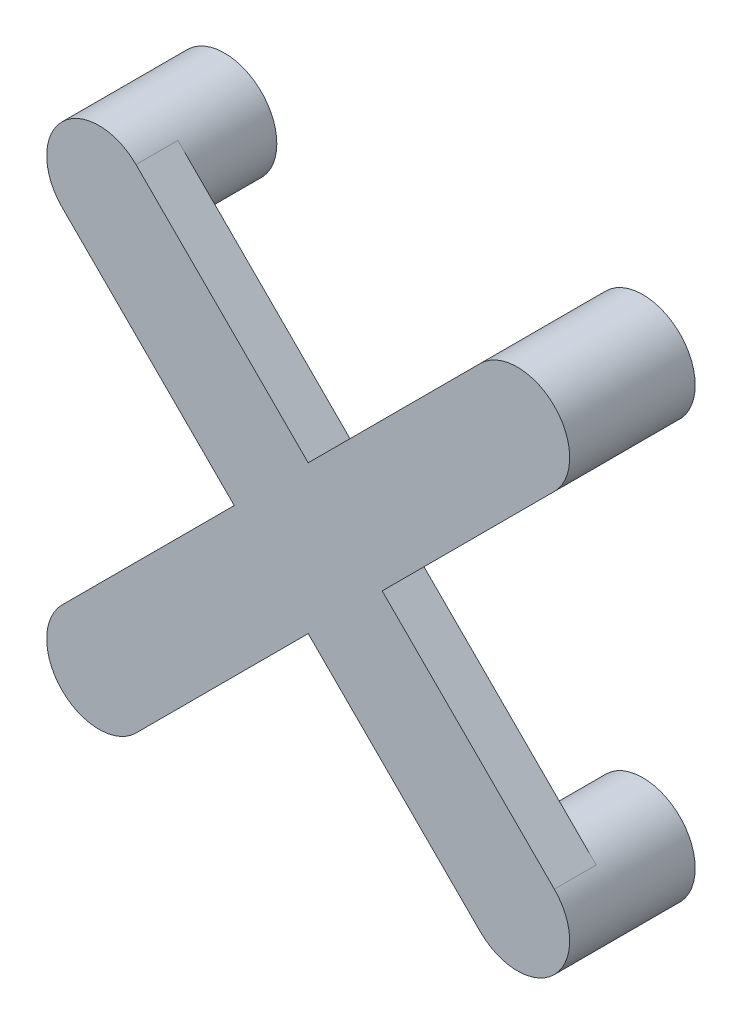
ISO-10303-21;
HEADER;
FILE_DESCRIPTION(('STEP AP214'),'2;1');
FILE_NAME('part.step','',(''),(''),'','','');
FILE_SCHEMA(('AUTOMOTIVE_DESIGN { 1 0 10303 214 1 1 1 1 }'));
ENDSEC;
DATA;
#1=APPLICATION_CONTEXT('core data for automotive mechanical design processes');
#2=APPLICATION_PROTOCOL_DEFINITION('international standard','automotive_design',2000,#1);
#3=PRODUCT_CONTEXT('',#1,'mechanical');
#4=PRODUCT('Part','Part','',(#3));
#5=PRODUCT_RELATED_PRODUCT_CATEGORY('part','',(#4));
#6=PRODUCT_DEFINITION_FORMATION('','',#4);
#7=PRODUCT_DEFINITION_CONTEXT('part definition',#1,'design');
#8=PRODUCT_DEFINITION('design','',#6,#7);
#9=PRODUCT_DEFINITION_SHAPE('','',#8);
#10=(LENGTH_UNIT() NAMED_UNIT(*) SI_UNIT(.MILLI.,.METRE.));
#11=(NAMED_UNIT(*) PLANE_ANGLE_UNIT() SI_UNIT($,.RADIAN.));
#12=(NAMED_UNIT(*) SI_UNIT($,.STERADIAN.) SOLID_ANGLE_UNIT());
#13=UNCERTAINTY_MEASURE_WITH_UNIT(LENGTH_MEASURE(1.E-05),#10,'distance_accuracy_value','');
#14=(GEOMETRIC_REPRESENTATION_CONTEXT(3) GLOBAL_UNCERTAINTY_ASSIGNED_CONTEXT((#13)) GLOBAL_UNIT_ASSIGNED_CONTEXT((#10,
#11,#12)) REPRESENTATION_CONTEXT('',''));
#15=CARTESIAN_POINT('',(0.,0.,0.));
#16=DIRECTION('',(0.,0.,1.));
#17=DIRECTION('',(1.,0.,0.));
#18=AXIS2_PLACEMENT_3D('',#15,#16,#17);
#19=CARTESIAN_POINT('',(-5.,5.,2.));
#20=DIRECTION('',(0.,0.,1.));
#21=DIRECTION('',(1.,0.,0.));
#22=AXIS2_PLACEMENT_3D('',#19,#20,#21);
#23=PLANE('',#22);
#24=CARTESIAN_POINT('',(-5.,-5.,2.));
#25=DIRECTION('',(0.,0.,1.));
#26=DIRECTION('',(1.,0.,0.));
#27=AXIS2_PLACEMENT_3D('',#24,#25,#26);
#28=CIRCLE('',#27,1.25);
#29=CARTESIAN_POINT('',(-4.11611652351681,-5.88388347648319,2.));
#30=VERTEX_POINT('',#29);
#31=CARTESIAN_POINT('',(-5.88388347648318,-4.11611652351682,2.));
#32=VERTEX_POINT('',#31);
#33=EDGE_CURVE('E262',#30,#32,#28,.T.);
#34=ORIENTED_EDGE('',*,*,#33,.T.);
#35=DIRECTION('',(-0.707106781186549,-0.707106781186547,0.));
#36=VECTOR('',#35,1.);
#37=CARTESIAN_POINT('',(-5.88388347648318,-4.11611652351682,2.));
#38=LINE('',#37,#36);
#39=CARTESIAN_POINT('',(-1.76776695296635,0.,2.));
#40=VERTEX_POINT('',#39);
#41=EDGE_CURVE('E153',#40,#32,#38,.T.);
#42=ORIENTED_EDGE('',*,*,#41,.F.);
#43=DIRECTION('',(0.707106781186549,-0.707106781186546,0.));
#44=VECTOR('',#43,1.);
#45=CARTESIAN_POINT('',(-1.76776695296635,0.,2.));
#46=LINE('',#45,#44);
#47=CARTESIAN_POINT('',(-5.88388347648318,4.11611652351681,2.));
#48=VERTEX_POINT('',#47);
#49=EDGE_CURVE('E151',#48,#40,#46,.T.);
#50=ORIENTED_EDGE('',*,*,#49,.F.);
#51=CARTESIAN_POINT('',(-5.,5.,2.));
#52=DIRECTION('',(0.,0.,1.));
#53=DIRECTION('',(1.,0.,0.));
#54=AXIS2_PLACEMENT_3D('',#51,#52,#53);
#55=CIRCLE('',#54,1.25);
#56=CARTESIAN_POINT('',(-4.11611652351681,5.88388347648318,2.));
#57=VERTEX_POINT('',#56);
#58=EDGE_CURVE('E11',#48,#57,#55,.T.);
#59=ORIENTED_EDGE('',*,*,#58,.T.);
#60=DIRECTION('',(-0.707106781186546,0.707106781186549,0.));
#61=VECTOR('',#60,1.);
#62=CARTESIAN_POINT('',(-4.11611652351681,5.88388347648318,2.));
#63=LINE('',#62,#61);
#64=CARTESIAN_POINT('',(0.,1.76776695296635,2.));
#65=VERTEX_POINT('',#64);
#66=EDGE_CURVE('E168',#65,#57,#63,.T.);
#67=ORIENTED_EDGE('',*,*,#66,.F.);
#68=DIRECTION('',(-0.707106781186546,-0.707106781186549,0.));
#69=VECTOR('',#68,1.);
#70=CARTESIAN_POINT('',(0.,1.76776695296635,2.));
#71=LINE('',#70,#69);
#72=CARTESIAN_POINT('',(4.11611652351682,5.88388347648318,2.));
#73=VERTEX_POINT('',#72);
#74=EDGE_CURVE('E166',#73,#65,#71,.T.);
#75=ORIENTED_EDGE('',*,*,#74,.F.);
#76=CARTESIAN_POINT('',(5.,5.,2.));
#77=DIRECTION('',(0.,0.,1.));
#78=DIRECTION('',(1.,0.,0.));
#79=AXIS2_PLACEMENT_3D('',#76,#77,#78);
#80=CIRCLE('',#79,1.25);
#81=CARTESIAN_POINT('',(5.88388347648318,4.11611652351681,2.));
#82=VERTEX_POINT('',#81);
#83=EDGE_CURVE('E138',#73,#82,#80,.T.);
#84=ORIENTED_EDGE('',*,*,#83,.T.);
#85=DIRECTION('',(0.707106781186549,0.707106781186546,0.));
#86=VECTOR('',#85,1.);
#87=CARTESIAN_POINT('',(5.88388347648318,4.11611652351681,2.));
#88=LINE('',#87,#86);
#89=CARTESIAN_POINT('',(1.76776695296635,0.,2.));
#90=VERTEX_POINT('',#89);
#91=EDGE_CURVE('E163',#90,#82,#88,.T.);
#92=ORIENTED_EDGE('',*,*,#91,.F.);
#93=DIRECTION('',(-0.707106781186548,0.707106781186547,0.));
#94=VECTOR('',#93,1.);
#95=CARTESIAN_POINT('',(1.76776695296635,0.,2.));
#96=LINE('',#95,#94);
#97=CARTESIAN_POINT('',(5.88388347648318,-4.11611652351682,2.));
#98=VERTEX_POINT('',#97);
#99=EDGE_CURVE('E161',#98,#90,#96,.T.);
#100=ORIENTED_EDGE('',*,*,#99,.F.);
#101=CARTESIAN_POINT('',(5.,-5.,2.));
#102=DIRECTION('',(0.,0.,1.));
#103=DIRECTION('',(1.,0.,0.));
#104=AXIS2_PLACEMENT_3D('',#101,#102,#103);
#105=CIRCLE('',#104,1.25);
#106=CARTESIAN_POINT('',(4.11611652351682,-5.88388347648319,2.));
#107=VERTEX_POINT('',#106);
#108=EDGE_CURVE('E285',#98,#107,#105,.T.);
#109=ORIENTED_EDGE('',*,*,#108,.T.);
#110=DIRECTION('',(0.707106781186546,-0.707106781186549,0.));
#111=VECTOR('',#110,1.);
#112=CARTESIAN_POINT('',(4.11611652351682,-5.88388347648319,2.));
#113=LINE('',#112,#111);
#114=CARTESIAN_POINT('',(0.,-1.76776695296636,2.));
#115=VERTEX_POINT('',#114);
#116=EDGE_CURVE('E158',#115,#107,#113,.T.);
#117=ORIENTED_EDGE('',*,*,#116,.F.);
#118=DIRECTION('',(0.707106781186546,0.707106781186549,0.));
#119=VECTOR('',#118,1.);
#120=CARTESIAN_POINT('',(0.,-1.76776695296636,2.));
#121=LINE('',#120,#119);
#122=EDGE_CURVE('E156',#30,#115,#121,.T.);
#123=ORIENTED_EDGE('',*,*,#122,.F.);
#124=EDGE_LOOP('',(#34,#42,#50,#59,#67,#75,#84,#92,#100,#109,#117,#123));
#125=FACE_BOUND('',#124,.T.);
#126=ADVANCED_FACE('F33',(#125),#23,.F.);
#127=CARTESIAN_POINT('',(-5.,5.,2.));
#128=DIRECTION('',(0.,0.,-1.));
#129=DIRECTION('',(-1.,0.,0.));
#130=AXIS2_PLACEMENT_3D('',#127,#128,#129);
#131=CYLINDRICAL_SURFACE('',#130,1.25);
#132=ORIENTED_EDGE('',*,*,#58,.F.);
#133=DIRECTION('',(0.,0.,-1.));
#134=VECTOR('',#133,1.);
#135=CARTESIAN_POINT('',(-5.88388347648318,4.11611652351681,3.));
#136=LINE('',#135,#134);
#137=CARTESIAN_POINT('',(-5.88388347648318,4.11611652351681,3.));
#138=VERTEX_POINT('',#137);
#139=EDGE_CURVE('E195',#138,#48,#136,.T.);
#140=ORIENTED_EDGE('',*,*,#139,.F.);
#141=CARTESIAN_POINT('',(-5.,5.,3.));
#142=DIRECTION('',(0.,0.,1.));
#143=DIRECTION('',(1.,0.,0.));
#144=AXIS2_PLACEMENT_3D('',#141,#142,#143);
#145=CIRCLE('',#144,1.25);
#146=CARTESIAN_POINT('',(-4.11611652351681,5.88388347648318,3.));
#147=VERTEX_POINT('',#146);
#148=EDGE_CURVE('E170',#147,#138,#145,.T.);
#149=ORIENTED_EDGE('',*,*,#148,.F.);
#150=DIRECTION('',(0.,0.,-1.));
#151=VECTOR('',#150,1.);
#152=CARTESIAN_POINT('',(-4.11611652351681,5.88388347648318,3.));
#153=LINE('',#152,#151);
#154=EDGE_CURVE('E147',#147,#57,#153,.T.);
#155=ORIENTED_EDGE('',*,*,#154,.T.);
#156=EDGE_LOOP('',(#132,#140,#149,#155));
#157=FACE_BOUND('',#156,.T.);
#158=CARTESIAN_POINT('',(-5.,5.,0.));
#159=DIRECTION('',(0.,0.,1.));
#160=DIRECTION('',(1.,0.,0.));
#161=AXIS2_PLACEMENT_3D('',#158,#159,#160);
#162=CIRCLE('',#161,1.25);
#163=CARTESIAN_POINT('',(-3.75,5.,0.));
#164=VERTEX_POINT('',#163);
#165=EDGE_CURVE('E37',#164,#164,#162,.T.);
#166=ORIENTED_EDGE('',*,*,#165,.T.);
#167=EDGE_LOOP('',(#166));
#168=FACE_BOUND('',#167,.T.);
#169=ADVANCED_FACE('F35',(#157,#168),#131,.T.);
#170=CARTESIAN_POINT('',(-5.,5.,0.));
#171=DIRECTION('',(0.,0.,1.));
#172=DIRECTION('',(1.,0.,0.));
#173=AXIS2_PLACEMENT_3D('',#170,#171,#172);
#174=PLANE('',#173);
#175=ORIENTED_EDGE('',*,*,#165,.F.);
#176=EDGE_LOOP('',(#175));
#177=FACE_BOUND('',#176,.T.);
#178=ADVANCED_FACE('F200',(#177),#174,.F.);
#179=CARTESIAN_POINT('',(-1.76776695296635,0.,3.));
#180=DIRECTION('',(0.707106781186546,0.707106781186549,0.));
#181=DIRECTION('',(-0.707106781186549,0.707106781186546,0.));
#182=AXIS2_PLACEMENT_3D('',#179,#180,#181);
#183=PLANE('',#182);
#184=ORIENTED_EDGE('',*,*,#49,.T.);
#185=DIRECTION('',(0.,0.,-1.));
#186=VECTOR('',#185,1.);
#187=CARTESIAN_POINT('',(-1.76776695296635,0.,3.));
#188=LINE('',#187,#186);
#189=CARTESIAN_POINT('',(-1.76776695296635,0.,3.));
#190=VERTEX_POINT('',#189);
#191=EDGE_CURVE('E192',#190,#40,#188,.T.);
#192=ORIENTED_EDGE('',*,*,#191,.F.);
#193=DIRECTION('',(0.707106781186549,-0.707106781186546,0.));
#194=VECTOR('',#193,1.);
#195=CARTESIAN_POINT('',(-1.76776695296635,0.,3.));
#196=LINE('',#195,#194);
#197=EDGE_CURVE('E94',#138,#190,#196,.T.);
#198=ORIENTED_EDGE('',*,*,#197,.F.);
#199=ORIENTED_EDGE('',*,*,#139,.T.);
#200=EDGE_LOOP('',(#184,#192,#198,#199));
#201=FACE_BOUND('',#200,.T.);
#202=ADVANCED_FACE('F202',(#201),#183,.F.);
#203=CARTESIAN_POINT('',(-5.88388347648318,-4.11611652351682,3.));
#204=DIRECTION('',(0.707106781186547,-0.707106781186549,0.));
#205=DIRECTION('',(0.707106781186549,0.707106781186547,0.));
#206=AXIS2_PLACEMENT_3D('',#203,#204,#205);
#207=PLANE('',#206);
#208=ORIENTED_EDGE('',*,*,#41,.T.);
#209=DIRECTION('',(0.,0.,-1.));
#210=VECTOR('',#209,1.);
#211=CARTESIAN_POINT('',(-5.88388347648318,-4.11611652351682,3.));
#212=LINE('',#211,#210);
#213=CARTESIAN_POINT('',(-5.88388347648318,-4.11611652351682,3.));
#214=VERTEX_POINT('',#213);
#215=EDGE_CURVE('E189',#214,#32,#212,.T.);
#216=ORIENTED_EDGE('',*,*,#215,.F.);
#217=DIRECTION('',(-0.707106781186549,-0.707106781186547,0.));
#218=VECTOR('',#217,1.);
#219=CARTESIAN_POINT('',(-5.88388347648318,-4.11611652351682,3.));
#220=LINE('',#219,#218);
#221=EDGE_CURVE('E266',#190,#214,#220,.T.);
#222=ORIENTED_EDGE('',*,*,#221,.F.);
#223=ORIENTED_EDGE('',*,*,#191,.T.);
#224=EDGE_LOOP('',(#208,#216,#222,#223));
#225=FACE_BOUND('',#224,.T.);
#226=ADVANCED_FACE('F207',(#225),#207,.F.);
#227=CARTESIAN_POINT('',(-5.,-5.,3.));
#228=DIRECTION('',(0.,0.,-1.));
#229=DIRECTION('',(-1.,0.,0.));
#230=AXIS2_PLACEMENT_3D('',#227,#228,#229);
#231=CYLINDRICAL_SURFACE('',#230,1.25);
#232=ORIENTED_EDGE('',*,*,#215,.T.);
#233=ORIENTED_EDGE('',*,*,#33,.F.);
#234=DIRECTION('',(0.,0.,-1.));
#235=VECTOR('',#234,1.);
#236=CARTESIAN_POINT('',(-4.11611652351681,-5.88388347648319,3.));
#237=LINE('',#236,#235);
#238=CARTESIAN_POINT('',(-4.11611652351681,-5.88388347648319,3.));
#239=VERTEX_POINT('',#238);
#240=EDGE_CURVE('E186',#239,#30,#237,.T.);
#241=ORIENTED_EDGE('',*,*,#240,.F.);
#242=CARTESIAN_POINT('',(-5.,-5.,3.));
#243=DIRECTION('',(0.,0.,1.));
#244=DIRECTION('',(1.,0.,0.));
#245=AXIS2_PLACEMENT_3D('',#242,#243,#244);
#246=CIRCLE('',#245,1.25);
#247=EDGE_CURVE('E263',#214,#239,#246,.T.);
#248=ORIENTED_EDGE('',*,*,#247,.F.);
#249=EDGE_LOOP('',(#232,#233,#241,#248));
#250=FACE_BOUND('',#249,.T.);
#251=CARTESIAN_POINT('',(-5.,-5.,0.));
#252=DIRECTION('',(0.,0.,1.));
#253=DIRECTION('',(1.,0.,0.));
#254=AXIS2_PLACEMENT_3D('',#251,#252,#253);
#255=CIRCLE('',#254,1.25);
#256=CARTESIAN_POINT('',(-3.75,-5.,0.));
#257=VERTEX_POINT('',#256);
#258=EDGE_CURVE('E298',#257,#257,#255,.T.);
#259=ORIENTED_EDGE('',*,*,#258,.T.);
#260=EDGE_LOOP('',(#259));
#261=FACE_BOUND('',#260,.T.);
#262=ADVANCED_FACE('F244',(#250,#261),#231,.T.);
#263=CARTESIAN_POINT('',(0.,-1.76776695296636,3.));
#264=DIRECTION('',(-0.707106781186549,0.707106781186546,0.));
#265=DIRECTION('',(-0.707106781186546,-0.707106781186549,0.));
#266=AXIS2_PLACEMENT_3D('',#263,#264,#265);
#267=PLANE('',#266);
#268=ORIENTED_EDGE('',*,*,#122,.T.);
#269=DIRECTION('',(0.,0.,-1.));
#270=VECTOR('',#269,1.);
#271=CARTESIAN_POINT('',(0.,-1.76776695296636,3.));
#272=LINE('',#271,#270);
#273=CARTESIAN_POINT('',(0.,-1.76776695296636,3.));
#274=VERTEX_POINT('',#273);
#275=EDGE_CURVE('E183',#274,#115,#272,.T.);
#276=ORIENTED_EDGE('',*,*,#275,.F.);
#277=DIRECTION('',(0.707106781186546,0.707106781186549,0.));
#278=VECTOR('',#277,1.);
#279=CARTESIAN_POINT('',(0.,-1.76776695296636,3.));
#280=LINE('',#279,#278);
#281=EDGE_CURVE('E265',#239,#274,#280,.T.);
#282=ORIENTED_EDGE('',*,*,#281,.F.);
#283=ORIENTED_EDGE('',*,*,#240,.T.);
#284=EDGE_LOOP('',(#268,#276,#282,#283));
#285=FACE_BOUND('',#284,.T.);
#286=ADVANCED_FACE('F240',(#285),#267,.F.);
#287=CARTESIAN_POINT('',(4.11611652351682,-5.88388347648319,3.));
#288=DIRECTION('',(0.707106781186549,0.707106781186546,0.));
#289=DIRECTION('',(-0.707106781186546,0.707106781186549,0.));
#290=AXIS2_PLACEMENT_3D('',#287,#288,#289);
#291=PLANE('',#290);
#292=ORIENTED_EDGE('',*,*,#116,.T.);
#293=DIRECTION('',(0.,0.,-1.));
#294=VECTOR('',#293,1.);
#295=CARTESIAN_POINT('',(4.11611652351682,-5.88388347648319,3.));
#296=LINE('',#295,#294);
#297=CARTESIAN_POINT('',(4.11611652351682,-5.88388347648319,3.));
#298=VERTEX_POINT('',#297);
#299=EDGE_CURVE('E180',#298,#107,#296,.T.);
#300=ORIENTED_EDGE('',*,*,#299,.F.);
#301=DIRECTION('',(0.707106781186546,-0.707106781186549,0.));
#302=VECTOR('',#301,1.);
#303=CARTESIAN_POINT('',(4.11611652351682,-5.88388347648319,3.));
#304=LINE('',#303,#302);
#305=EDGE_CURVE('E268',#274,#298,#304,.T.);
#306=ORIENTED_EDGE('',*,*,#305,.F.);
#307=ORIENTED_EDGE('',*,*,#275,.T.);
#308=EDGE_LOOP('',(#292,#300,#306,#307));
#309=FACE_BOUND('',#308,.T.);
#310=ADVANCED_FACE('F236',(#309),#291,.F.);
#311=CARTESIAN_POINT('',(5.,-5.,3.));
#312=DIRECTION('',(0.,0.,-1.));
#313=DIRECTION('',(-1.,0.,0.));
#314=AXIS2_PLACEMENT_3D('',#311,#312,#313);
#315=CYLINDRICAL_SURFACE('',#314,1.25);
#316=ORIENTED_EDGE('',*,*,#299,.T.);
#317=ORIENTED_EDGE('',*,*,#108,.F.);
#318=DIRECTION('',(0.,0.,-1.));
#319=VECTOR('',#318,1.);
#320=CARTESIAN_POINT('',(5.88388347648318,-4.11611652351682,3.));
#321=LINE('',#320,#319);
#322=CARTESIAN_POINT('',(5.88388347648318,-4.11611652351682,3.));
#323=VERTEX_POINT('',#322);
#324=EDGE_CURVE('E177',#323,#98,#321,.T.);
#325=ORIENTED_EDGE('',*,*,#324,.F.);
#326=CARTESIAN_POINT('',(5.,-5.,3.));
#327=DIRECTION('',(0.,0.,1.));
#328=DIRECTION('',(-1.,0.,0.));
#329=AXIS2_PLACEMENT_3D('',#326,#327,#328);
#330=CIRCLE('',#329,1.25);
#331=EDGE_CURVE('E274',#298,#323,#330,.T.);
#332=ORIENTED_EDGE('',*,*,#331,.F.);
#333=EDGE_LOOP('',(#316,#317,#325,#332));
#334=FACE_BOUND('',#333,.T.);
#335=CARTESIAN_POINT('',(5.,-5.,0.));
#336=DIRECTION('',(0.,0.,1.));
#337=DIRECTION('',(1.,0.,0.));
#338=AXIS2_PLACEMENT_3D('',#335,#336,#337);
#339=CIRCLE('',#338,1.25);
#340=CARTESIAN_POINT('',(6.25,-5.,0.));
#341=VERTEX_POINT('',#340);
#342=EDGE_CURVE('E288',#341,#341,#339,.T.);
#343=ORIENTED_EDGE('',*,*,#342,.T.);
#344=EDGE_LOOP('',(#343));
#345=FACE_BOUND('',#344,.T.);
#346=ADVANCED_FACE('F232',(#334,#345),#315,.T.);
#347=CARTESIAN_POINT('',(1.76776695296635,0.,3.));
#348=DIRECTION('',(-0.707106781186547,-0.707106781186548,0.));
#349=DIRECTION('',(0.707106781186548,-0.707106781186547,0.));
#350=AXIS2_PLACEMENT_3D('',#347,#348,#349);
#351=PLANE('',#350);
#352=ORIENTED_EDGE('',*,*,#99,.T.);
#353=DIRECTION('',(0.,0.,-1.));
#354=VECTOR('',#353,1.);
#355=CARTESIAN_POINT('',(1.76776695296635,0.,3.));
#356=LINE('',#355,#354);
#357=CARTESIAN_POINT('',(1.76776695296635,0.,3.));
#358=VERTEX_POINT('',#357);
#359=EDGE_CURVE('E174',#358,#90,#356,.T.);
#360=ORIENTED_EDGE('',*,*,#359,.F.);
#361=DIRECTION('',(-0.707106781186548,0.707106781186547,0.));
#362=VECTOR('',#361,1.);
#363=CARTESIAN_POINT('',(1.76776695296635,0.,3.));
#364=LINE('',#363,#362);
#365=EDGE_CURVE('E276',#323,#358,#364,.T.);
#366=ORIENTED_EDGE('',*,*,#365,.F.);
#367=ORIENTED_EDGE('',*,*,#324,.T.);
#368=EDGE_LOOP('',(#352,#360,#366,#367));
#369=FACE_BOUND('',#368,.T.);
#370=ADVANCED_FACE('F228',(#369),#351,.F.);
#371=CARTESIAN_POINT('',(5.88388347648318,4.11611652351681,3.));
#372=DIRECTION('',(-0.707106781186546,0.707106781186549,0.));
#373=DIRECTION('',(-0.707106781186549,-0.707106781186546,0.));
#374=AXIS2_PLACEMENT_3D('',#371,#372,#373);
#375=PLANE('',#374);
#376=ORIENTED_EDGE('',*,*,#91,.T.);
#377=DIRECTION('',(0.,0.,-1.));
#378=VECTOR('',#377,1.);
#379=CARTESIAN_POINT('',(5.88388347648318,4.11611652351681,3.));
#380=LINE('',#379,#378);
#381=CARTESIAN_POINT('',(5.88388347648318,4.11611652351681,3.));
#382=VERTEX_POINT('',#381);
#383=EDGE_CURVE('E141',#382,#82,#380,.T.);
#384=ORIENTED_EDGE('',*,*,#383,.F.);
#385=DIRECTION('',(0.707106781186549,0.707106781186546,0.));
#386=VECTOR('',#385,1.);
#387=CARTESIAN_POINT('',(5.88388347648318,4.11611652351681,3.));
#388=LINE('',#387,#386);
#389=EDGE_CURVE('E128',#358,#382,#388,.T.);
#390=ORIENTED_EDGE('',*,*,#389,.F.);
#391=ORIENTED_EDGE('',*,*,#359,.T.);
#392=EDGE_LOOP('',(#376,#384,#390,#391));
#393=FACE_BOUND('',#392,.T.);
#394=ADVANCED_FACE('F225',(#393),#375,.F.);
#395=CARTESIAN_POINT('',(5.,5.,3.));
#396=DIRECTION('',(0.,0.,-1.));
#397=DIRECTION('',(-1.,0.,0.));
#398=AXIS2_PLACEMENT_3D('',#395,#396,#397);
#399=CYLINDRICAL_SURFACE('',#398,1.25);
#400=ORIENTED_EDGE('',*,*,#383,.T.);
#401=ORIENTED_EDGE('',*,*,#83,.F.);
#402=DIRECTION('',(0.,0.,-1.));
#403=VECTOR('',#402,1.);
#404=CARTESIAN_POINT('',(4.11611652351682,5.88388347648318,3.));
#405=LINE('',#404,#403);
#406=CARTESIAN_POINT('',(4.11611652351682,5.88388347648318,3.));
#407=VERTEX_POINT('',#406);
#408=EDGE_CURVE('E134',#407,#73,#405,.T.);
#409=ORIENTED_EDGE('',*,*,#408,.F.);
#410=CARTESIAN_POINT('',(5.,5.,3.));
#411=DIRECTION('',(0.,0.,1.));
#412=DIRECTION('',(1.,0.,0.));
#413=AXIS2_PLACEMENT_3D('',#410,#411,#412);
#414=CIRCLE('',#413,1.25);
#415=EDGE_CURVE('E121',#382,#407,#414,.T.);
#416=ORIENTED_EDGE('',*,*,#415,.F.);
#417=EDGE_LOOP('',(#400,#401,#409,#416));
#418=FACE_BOUND('',#417,.T.);
#419=CARTESIAN_POINT('',(5.,5.,0.));
#420=DIRECTION('',(0.,0.,1.));
#421=DIRECTION('',(1.,0.,0.));
#422=AXIS2_PLACEMENT_3D('',#419,#420,#421);
#423=CIRCLE('',#422,1.25);
#424=CARTESIAN_POINT('',(6.25,5.,0.));
#425=VERTEX_POINT('',#424);
#426=EDGE_CURVE('E287',#425,#425,#423,.T.);
#427=ORIENTED_EDGE('',*,*,#426,.T.);
#428=EDGE_LOOP('',(#427));
#429=FACE_BOUND('',#428,.T.);
#430=ADVANCED_FACE('F135',(#418,#429),#399,.T.);
#431=CARTESIAN_POINT('',(0.,1.76776695296635,3.));
#432=DIRECTION('',(0.707106781186549,-0.707106781186546,0.));
#433=DIRECTION('',(0.707106781186546,0.707106781186549,0.));
#434=AXIS2_PLACEMENT_3D('',#431,#432,#433);
#435=PLANE('',#434);
#436=ORIENTED_EDGE('',*,*,#74,.T.);
#437=DIRECTION('',(0.,0.,-1.));
#438=VECTOR('',#437,1.);
#439=CARTESIAN_POINT('',(0.,1.76776695296635,3.));
#440=LINE('',#439,#438);
#441=CARTESIAN_POINT('',(0.,1.76776695296635,3.));
#442=VERTEX_POINT('',#441);
#443=EDGE_CURVE('E142',#442,#65,#440,.T.);
#444=ORIENTED_EDGE('',*,*,#443,.F.);
#445=DIRECTION('',(-0.707106781186546,-0.707106781186549,0.));
#446=VECTOR('',#445,1.);
#447=CARTESIAN_POINT('',(0.,1.76776695296635,3.));
#448=LINE('',#447,#446);
#449=EDGE_CURVE('E125',#407,#442,#448,.T.);
#450=ORIENTED_EDGE('',*,*,#449,.F.);
#451=ORIENTED_EDGE('',*,*,#408,.T.);
#452=EDGE_LOOP('',(#436,#444,#450,#451));
#453=FACE_BOUND('',#452,.T.);
#454=ADVANCED_FACE('F144',(#453),#435,.F.);
#455=CARTESIAN_POINT('',(-4.11611652351681,5.88388347648318,3.));
#456=DIRECTION('',(-0.707106781186549,-0.707106781186546,0.));
#457=DIRECTION('',(0.707106781186546,-0.707106781186549,0.));
#458=AXIS2_PLACEMENT_3D('',#455,#456,#457);
#459=PLANE('',#458);
#460=ORIENTED_EDGE('',*,*,#66,.T.);
#461=ORIENTED_EDGE('',*,*,#154,.F.);
#462=DIRECTION('',(-0.707106781186546,0.707106781186549,0.));
#463=VECTOR('',#462,1.);
#464=CARTESIAN_POINT('',(-4.11611652351681,5.88388347648318,3.));
#465=LINE('',#464,#463);
#466=EDGE_CURVE('E55',#442,#147,#465,.T.);
#467=ORIENTED_EDGE('',*,*,#466,.F.);
#468=ORIENTED_EDGE('',*,*,#443,.T.);
#469=EDGE_LOOP('',(#460,#461,#467,#468));
#470=FACE_BOUND('',#469,.T.);
#471=ADVANCED_FACE('F217',(#470),#459,.F.);
#472=CARTESIAN_POINT('',(-5.,5.,3.));
#473=DIRECTION('',(0.,0.,1.));
#474=DIRECTION('',(1.,0.,0.));
#475=AXIS2_PLACEMENT_3D('',#472,#473,#474);
#476=PLANE('',#475);
#477=ORIENTED_EDGE('',*,*,#148,.T.);
#478=ORIENTED_EDGE('',*,*,#197,.T.);
#479=ORIENTED_EDGE('',*,*,#221,.T.);
#480=ORIENTED_EDGE('',*,*,#247,.T.);
#481=ORIENTED_EDGE('',*,*,#281,.T.);
#482=ORIENTED_EDGE('',*,*,#305,.T.);
#483=ORIENTED_EDGE('',*,*,#331,.T.);
#484=ORIENTED_EDGE('',*,*,#365,.T.);
#485=ORIENTED_EDGE('',*,*,#389,.T.);
#486=ORIENTED_EDGE('',*,*,#415,.T.);
#487=ORIENTED_EDGE('',*,*,#449,.T.);
#488=ORIENTED_EDGE('',*,*,#466,.T.);
#489=EDGE_LOOP('',(#477,#478,#479,#480,#481,#482,#483,#484,#485,#486,#487,#488));
#490=FACE_BOUND('',#489,.T.);
#491=ADVANCED_FACE('F123',(#490),#476,.T.);
#492=CARTESIAN_POINT('',(5.,5.,0.));
#493=DIRECTION('',(0.,0.,1.));
#494=DIRECTION('',(1.,0.,0.));
#495=AXIS2_PLACEMENT_3D('',#492,#493,#494);
#496=PLANE('',#495);
#497=ORIENTED_EDGE('',*,*,#426,.F.);
#498=EDGE_LOOP('',(#497));
#499=FACE_BOUND('',#498,.T.);
#500=ADVANCED_FACE('F308',(#499),#496,.F.);
#501=CARTESIAN_POINT('',(5.,-5.,0.));
#502=DIRECTION('',(0.,0.,1.));
#503=DIRECTION('',(1.,0.,0.));
#504=AXIS2_PLACEMENT_3D('',#501,#502,#503);
#505=PLANE('',#504);
#506=ORIENTED_EDGE('',*,*,#342,.F.);
#507=EDGE_LOOP('',(#506));
#508=FACE_BOUND('',#507,.T.);
#509=ADVANCED_FACE('F310',(#508),#505,.F.);
#510=CARTESIAN_POINT('',(-5.,-5.,0.));
#511=DIRECTION('',(0.,0.,1.));
#512=DIRECTION('',(1.,0.,0.));
#513=AXIS2_PLACEMENT_3D('',#510,#511,#512);
#514=PLANE('',#513);
#515=ORIENTED_EDGE('',*,*,#258,.F.);
#516=EDGE_LOOP('',(#515));
#517=FACE_BOUND('',#516,.T.);
#518=ADVANCED_FACE('F315',(#517),#514,.F.);
#519=CLOSED_SHELL('',(#126,#169,#178,#202,#226,#262,#286,#310,#346,#370,#394,#430,#454,#471,
#491,#500,#509,#518));
#520=MANIFOLD_SOLID_BREP('B2',#519);
#521=ADVANCED_BREP_SHAPE_REPRESENTATION('',(#18,#520),#14);
#522=SHAPE_DEFINITION_REPRESENTATION(#9,#521);
ENDSEC;
END-ISO-10303-21;
